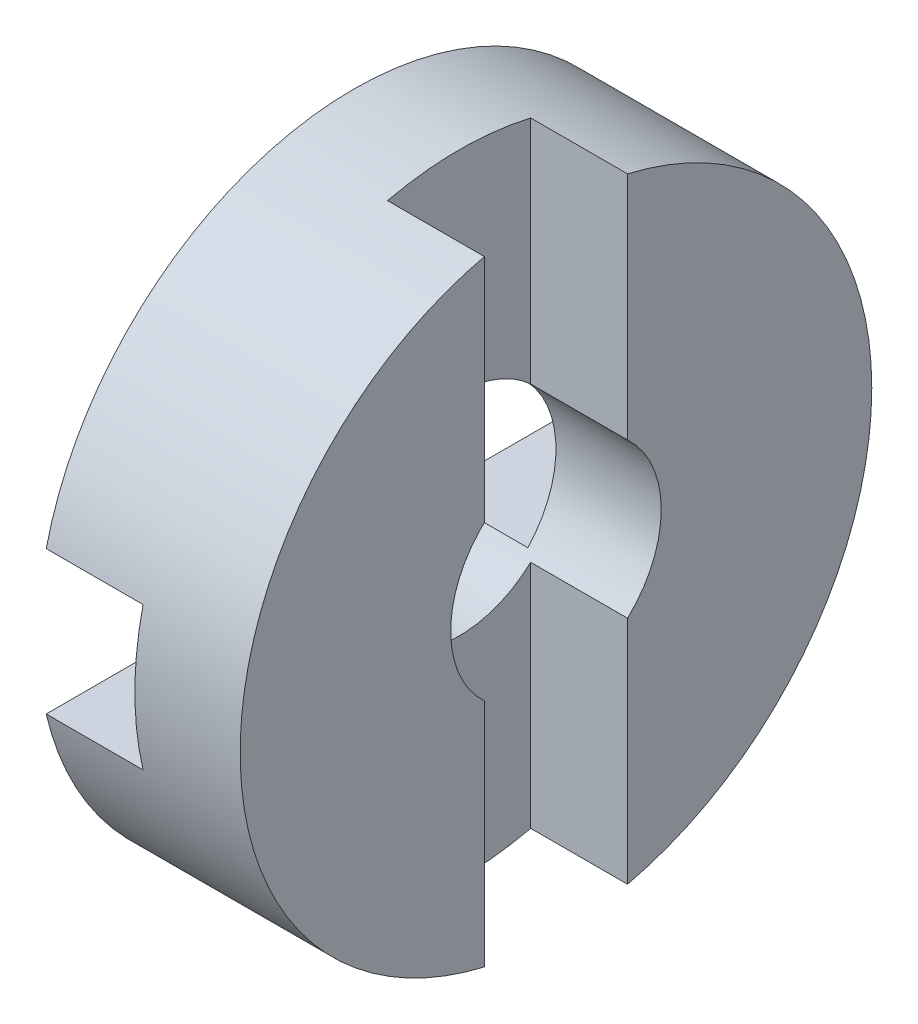
ISO-10303-21;
HEADER;
FILE_DESCRIPTION(('STEP AP214'),'2;1');
FILE_NAME('part.step','',(''),(''),'','','');
FILE_SCHEMA(('AUTOMOTIVE_DESIGN { 1 0 10303 214 1 1 1 1 }'));
ENDSEC;
DATA;
#1=APPLICATION_CONTEXT('core data for automotive mechanical design processes');
#2=APPLICATION_PROTOCOL_DEFINITION('international standard','automotive_design',2000,#1);
#3=PRODUCT_CONTEXT('',#1,'mechanical');
#4=PRODUCT('Part','Part','',(#3));
#5=PRODUCT_RELATED_PRODUCT_CATEGORY('part','',(#4));
#6=PRODUCT_DEFINITION_FORMATION('','',#4);
#7=PRODUCT_DEFINITION_CONTEXT('part definition',#1,'design');
#8=PRODUCT_DEFINITION('design','',#6,#7);
#9=PRODUCT_DEFINITION_SHAPE('','',#8);
#10=(LENGTH_UNIT() NAMED_UNIT(*) SI_UNIT(.MILLI.,.METRE.));
#11=(NAMED_UNIT(*) PLANE_ANGLE_UNIT() SI_UNIT($,.RADIAN.));
#12=(NAMED_UNIT(*) SI_UNIT($,.STERADIAN.) SOLID_ANGLE_UNIT());
#13=UNCERTAINTY_MEASURE_WITH_UNIT(LENGTH_MEASURE(1.E-05),#10,'distance_accuracy_value','');
#14=(GEOMETRIC_REPRESENTATION_CONTEXT(3) GLOBAL_UNCERTAINTY_ASSIGNED_CONTEXT((#13)) GLOBAL_UNIT_ASSIGNED_CONTEXT((#10,
#11,#12)) REPRESENTATION_CONTEXT('',''));
#15=CARTESIAN_POINT('',(0.,0.,0.));
#16=DIRECTION('',(0.,0.,1.));
#17=DIRECTION('',(1.,0.,0.));
#18=AXIS2_PLACEMENT_3D('',#15,#16,#17);
#19=CARTESIAN_POINT('',(4.8,0.,0.));
#20=DIRECTION('',(-1.,0.,0.));
#21=DIRECTION('',(0.,0.,1.));
#22=AXIS2_PLACEMENT_3D('',#19,#20,#21);
#23=CYLINDRICAL_SURFACE('',#22,7.5);
#24=CARTESIAN_POINT('',(2.3,0.,0.));
#25=DIRECTION('',(-1.,0.,0.));
#26=DIRECTION('',(0.,0.,1.));
#27=AXIS2_PLACEMENT_3D('',#24,#25,#26);
#28=CIRCLE('',#27,7.5);
#29=CARTESIAN_POINT('',(2.3,-1.7,7.30479294709987));
#30=VERTEX_POINT('',#29);
#31=CARTESIAN_POINT('',(2.3,1.7,7.30479294709987));
#32=VERTEX_POINT('',#31);
#33=EDGE_CURVE('E198',#30,#32,#28,.T.);
#34=ORIENTED_EDGE('',*,*,#33,.F.);
#35=DIRECTION('',(-1.,0.,0.));
#36=VECTOR('',#35,1.);
#37=CARTESIAN_POINT('',(4.8,-1.7,7.30479294709987));
#38=LINE('',#37,#36);
#39=CARTESIAN_POINT('',(0.,-1.7,7.30479294709987));
#40=VERTEX_POINT('',#39);
#41=EDGE_CURVE('E201',#40,#30,#38,.F.);
#42=ORIENTED_EDGE('',*,*,#41,.F.);
#43=CARTESIAN_POINT('',(0.,0.,0.));
#44=DIRECTION('',(-1.,0.,0.));
#45=DIRECTION('',(0.,0.,1.));
#46=AXIS2_PLACEMENT_3D('',#43,#44,#45);
#47=CIRCLE('',#46,7.5);
#48=CARTESIAN_POINT('',(0.,-1.7,-7.30479294709987));
#49=VERTEX_POINT('',#48);
#50=EDGE_CURVE('E215',#49,#40,#47,.T.);
#51=ORIENTED_EDGE('',*,*,#50,.F.);
#52=DIRECTION('',(-1.,0.,0.));
#53=VECTOR('',#52,1.);
#54=CARTESIAN_POINT('',(4.8,-1.7,-7.30479294709987));
#55=LINE('',#54,#53);
#56=CARTESIAN_POINT('',(2.3,-1.7,-7.30479294709987));
#57=VERTEX_POINT('',#56);
#58=EDGE_CURVE('E204',#57,#49,#55,.T.);
#59=ORIENTED_EDGE('',*,*,#58,.F.);
#60=CARTESIAN_POINT('',(2.3,1.7,-7.30479294709987));
#61=VERTEX_POINT('',#60);
#62=EDGE_CURVE('E199',#61,#57,#28,.T.);
#63=ORIENTED_EDGE('',*,*,#62,.F.);
#64=DIRECTION('',(-1.,0.,0.));
#65=VECTOR('',#64,1.);
#66=CARTESIAN_POINT('',(4.8,1.7,-7.30479294709987));
#67=LINE('',#66,#65);
#68=CARTESIAN_POINT('',(0.,1.7,-7.30479294709987));
#69=VERTEX_POINT('',#68);
#70=EDGE_CURVE('E194',#69,#61,#67,.F.);
#71=ORIENTED_EDGE('',*,*,#70,.F.);
#72=CARTESIAN_POINT('',(0.,1.7,7.30479294709987));
#73=VERTEX_POINT('',#72);
#74=EDGE_CURVE('E219',#73,#69,#47,.T.);
#75=ORIENTED_EDGE('',*,*,#74,.F.);
#76=DIRECTION('',(-1.,0.,0.));
#77=VECTOR('',#76,1.);
#78=CARTESIAN_POINT('',(4.8,1.7,7.30479294709987));
#79=LINE('',#78,#77);
#80=EDGE_CURVE('E196',#32,#73,#79,.T.);
#81=ORIENTED_EDGE('',*,*,#80,.F.);
#82=EDGE_LOOP('',(#34,#42,#51,#59,#63,#71,#75,#81));
#83=FACE_BOUND('',#82,.T.);
#84=DIRECTION('',(-1.,0.,0.));
#85=VECTOR('',#84,1.);
#86=CARTESIAN_POINT('',(4.8,7.30479294709987,-1.7));
#87=LINE('',#86,#85);
#88=CARTESIAN_POINT('',(4.8,7.30479294709987,-1.7));
#89=VERTEX_POINT('',#88);
#90=CARTESIAN_POINT('',(2.5,7.30479294709987,-1.7));
#91=VERTEX_POINT('',#90);
#92=EDGE_CURVE('E178',#89,#91,#87,.T.);
#93=ORIENTED_EDGE('',*,*,#92,.F.);
#94=CARTESIAN_POINT('',(4.8,0.,0.));
#95=DIRECTION('',(-1.,0.,0.));
#96=DIRECTION('',(0.,0.,1.));
#97=AXIS2_PLACEMENT_3D('',#94,#95,#96);
#98=CIRCLE('',#97,7.5);
#99=CARTESIAN_POINT('',(4.8,-7.30479294709987,-1.7));
#100=VERTEX_POINT('',#99);
#101=EDGE_CURVE('E207',#89,#100,#98,.T.);
#102=ORIENTED_EDGE('',*,*,#101,.T.);
#103=DIRECTION('',(-1.,0.,0.));
#104=VECTOR('',#103,1.);
#105=CARTESIAN_POINT('',(4.8,-7.30479294709987,-1.7));
#106=LINE('',#105,#104);
#107=CARTESIAN_POINT('',(2.5,-7.30479294709987,-1.7));
#108=VERTEX_POINT('',#107);
#109=EDGE_CURVE('E176',#108,#100,#106,.F.);
#110=ORIENTED_EDGE('',*,*,#109,.F.);
#111=CARTESIAN_POINT('',(2.5,0.,0.));
#112=DIRECTION('',(1.,0.,0.));
#113=DIRECTION('',(0.,0.,-1.));
#114=AXIS2_PLACEMENT_3D('',#111,#112,#113);
#115=CIRCLE('',#114,7.5);
#116=CARTESIAN_POINT('',(2.5,-7.30479294709987,1.7));
#117=VERTEX_POINT('',#116);
#118=EDGE_CURVE('E154',#117,#108,#115,.T.);
#119=ORIENTED_EDGE('',*,*,#118,.F.);
#120=DIRECTION('',(-1.,0.,0.));
#121=VECTOR('',#120,1.);
#122=CARTESIAN_POINT('',(4.8,-7.30479294709987,1.7));
#123=LINE('',#122,#121);
#124=CARTESIAN_POINT('',(4.8,-7.30479294709987,1.7));
#125=VERTEX_POINT('',#124);
#126=EDGE_CURVE('E166',#125,#117,#123,.T.);
#127=ORIENTED_EDGE('',*,*,#126,.F.);
#128=CARTESIAN_POINT('',(4.8,7.30479294709987,1.7));
#129=VERTEX_POINT('',#128);
#130=EDGE_CURVE('E165',#125,#129,#98,.T.);
#131=ORIENTED_EDGE('',*,*,#130,.T.);
#132=DIRECTION('',(-1.,0.,0.));
#133=VECTOR('',#132,1.);
#134=CARTESIAN_POINT('',(4.8,7.30479294709987,1.7));
#135=LINE('',#134,#133);
#136=CARTESIAN_POINT('',(2.5,7.30479294709987,1.7));
#137=VERTEX_POINT('',#136);
#138=EDGE_CURVE('E53',#137,#129,#135,.F.);
#139=ORIENTED_EDGE('',*,*,#138,.F.);
#140=EDGE_CURVE('E145',#91,#137,#115,.T.);
#141=ORIENTED_EDGE('',*,*,#140,.F.);
#142=EDGE_LOOP('',(#93,#102,#110,#119,#127,#131,#139,#141));
#143=FACE_BOUND('',#142,.T.);
#144=ADVANCED_FACE('F31',(#83,#143),#23,.T.);
#145=CARTESIAN_POINT('',(4.8,0.,0.));
#146=DIRECTION('',(-1.,0.,0.));
#147=DIRECTION('',(0.,0.,1.));
#148=AXIS2_PLACEMENT_3D('',#145,#146,#147);
#149=CYLINDRICAL_SURFACE('',#148,2.5);
#150=DIRECTION('',(-1.,0.,0.));
#151=VECTOR('',#150,1.);
#152=CARTESIAN_POINT('',(4.8,-1.7,1.83303027798234));
#153=LINE('',#152,#151);
#154=CARTESIAN_POINT('',(2.3,-1.7,1.83303027798234));
#155=VERTEX_POINT('',#154);
#156=CARTESIAN_POINT('',(0.,-1.7,1.83303027798234));
#157=VERTEX_POINT('',#156);
#158=EDGE_CURVE('E230',#155,#157,#153,.T.);
#159=ORIENTED_EDGE('',*,*,#158,.F.);
#160=CARTESIAN_POINT('',(2.3,0.,0.));
#161=DIRECTION('',(-1.,0.,0.));
#162=DIRECTION('',(0.,0.,1.));
#163=AXIS2_PLACEMENT_3D('',#160,#161,#162);
#164=CIRCLE('',#163,2.5);
#165=CARTESIAN_POINT('',(2.3,1.7,1.83303027798234));
#166=VERTEX_POINT('',#165);
#167=EDGE_CURVE('E226',#166,#155,#164,.F.);
#168=ORIENTED_EDGE('',*,*,#167,.F.);
#169=DIRECTION('',(-1.,0.,0.));
#170=VECTOR('',#169,1.);
#171=CARTESIAN_POINT('',(4.8,1.7,1.83303027798234));
#172=LINE('',#171,#170);
#173=CARTESIAN_POINT('',(0.,1.7,1.83303027798234));
#174=VERTEX_POINT('',#173);
#175=EDGE_CURVE('E228',#174,#166,#172,.F.);
#176=ORIENTED_EDGE('',*,*,#175,.F.);
#177=CARTESIAN_POINT('',(0.,0.,0.));
#178=DIRECTION('',(-1.,0.,0.));
#179=DIRECTION('',(0.,0.,1.));
#180=AXIS2_PLACEMENT_3D('',#177,#178,#179);
#181=CIRCLE('',#180,2.5);
#182=CARTESIAN_POINT('',(0.,1.7,-1.83303027798234));
#183=VERTEX_POINT('',#182);
#184=EDGE_CURVE('E212',#174,#183,#181,.T.);
#185=ORIENTED_EDGE('',*,*,#184,.T.);
#186=DIRECTION('',(-1.,0.,0.));
#187=VECTOR('',#186,1.);
#188=CARTESIAN_POINT('',(4.8,1.7,-1.83303027798234));
#189=LINE('',#188,#187);
#190=CARTESIAN_POINT('',(2.3,1.7,-1.83303027798234));
#191=VERTEX_POINT('',#190);
#192=EDGE_CURVE('E220',#191,#183,#189,.T.);
#193=ORIENTED_EDGE('',*,*,#192,.F.);
#194=CARTESIAN_POINT('',(2.3,-1.7,-1.83303027798234));
#195=VERTEX_POINT('',#194);
#196=EDGE_CURVE('E222',#195,#191,#164,.F.);
#197=ORIENTED_EDGE('',*,*,#196,.F.);
#198=DIRECTION('',(-1.,0.,0.));
#199=VECTOR('',#198,1.);
#200=CARTESIAN_POINT('',(4.8,-1.7,-1.83303027798234));
#201=LINE('',#200,#199);
#202=CARTESIAN_POINT('',(0.,-1.7,-1.83303027798234));
#203=VERTEX_POINT('',#202);
#204=EDGE_CURVE('E225',#203,#195,#201,.F.);
#205=ORIENTED_EDGE('',*,*,#204,.F.);
#206=EDGE_CURVE('E216',#203,#157,#181,.T.);
#207=ORIENTED_EDGE('',*,*,#206,.T.);
#208=EDGE_LOOP('',(#159,#168,#176,#185,#193,#197,#205,#207));
#209=FACE_BOUND('',#208,.T.);
#210=DIRECTION('',(-1.,0.,0.));
#211=VECTOR('',#210,1.);
#212=CARTESIAN_POINT('',(4.8,-1.83303027798234,-1.7));
#213=LINE('',#212,#211);
#214=CARTESIAN_POINT('',(4.8,-1.83303027798234,-1.7));
#215=VERTEX_POINT('',#214);
#216=CARTESIAN_POINT('',(2.5,-1.83303027798234,-1.7));
#217=VERTEX_POINT('',#216);
#218=EDGE_CURVE('E168',#215,#217,#213,.T.);
#219=ORIENTED_EDGE('',*,*,#218,.F.);
#220=CARTESIAN_POINT('',(4.8,0.,0.));
#221=DIRECTION('',(-1.,0.,0.));
#222=DIRECTION('',(0.,0.,1.));
#223=AXIS2_PLACEMENT_3D('',#220,#221,#222);
#224=CIRCLE('',#223,2.5);
#225=CARTESIAN_POINT('',(4.8,1.83303027798234,-1.7));
#226=VERTEX_POINT('',#225);
#227=EDGE_CURVE('E211',#226,#215,#224,.T.);
#228=ORIENTED_EDGE('',*,*,#227,.F.);
#229=DIRECTION('',(-1.,0.,0.));
#230=VECTOR('',#229,1.);
#231=CARTESIAN_POINT('',(4.8,1.83303027798234,-1.7));
#232=LINE('',#231,#230);
#233=CARTESIAN_POINT('',(2.5,1.83303027798234,-1.7));
#234=VERTEX_POINT('',#233);
#235=EDGE_CURVE('E174',#234,#226,#232,.F.);
#236=ORIENTED_EDGE('',*,*,#235,.F.);
#237=CARTESIAN_POINT('',(2.5,0.,0.));
#238=DIRECTION('',(1.,0.,0.));
#239=DIRECTION('',(0.,0.,-1.));
#240=AXIS2_PLACEMENT_3D('',#237,#238,#239);
#241=CIRCLE('',#240,2.5);
#242=CARTESIAN_POINT('',(2.5,1.83303027798234,1.7));
#243=VERTEX_POINT('',#242);
#244=EDGE_CURVE('E34',#243,#234,#241,.F.);
#245=ORIENTED_EDGE('',*,*,#244,.F.);
#246=DIRECTION('',(-1.,0.,0.));
#247=VECTOR('',#246,1.);
#248=CARTESIAN_POINT('',(4.8,1.83303027798234,1.7));
#249=LINE('',#248,#247);
#250=CARTESIAN_POINT('',(4.8,1.83303027798234,1.7));
#251=VERTEX_POINT('',#250);
#252=EDGE_CURVE('E158',#251,#243,#249,.T.);
#253=ORIENTED_EDGE('',*,*,#252,.F.);
#254=CARTESIAN_POINT('',(4.8,-1.83303027798234,1.7));
#255=VERTEX_POINT('',#254);
#256=EDGE_CURVE('E208',#255,#251,#224,.T.);
#257=ORIENTED_EDGE('',*,*,#256,.F.);
#258=DIRECTION('',(-1.,0.,0.));
#259=VECTOR('',#258,1.);
#260=CARTESIAN_POINT('',(4.8,-1.83303027798234,1.7));
#261=LINE('',#260,#259);
#262=CARTESIAN_POINT('',(2.5,-1.83303027798234,1.7));
#263=VERTEX_POINT('',#262);
#264=EDGE_CURVE('E45',#263,#255,#261,.F.);
#265=ORIENTED_EDGE('',*,*,#264,.F.);
#266=EDGE_CURVE('E11',#217,#263,#241,.F.);
#267=ORIENTED_EDGE('',*,*,#266,.F.);
#268=EDGE_LOOP('',(#219,#228,#236,#245,#253,#257,#265,#267));
#269=FACE_BOUND('',#268,.T.);
#270=ADVANCED_FACE('F242',(#209,#269),#149,.F.);
#271=CARTESIAN_POINT('',(4.8,2.5,0.));
#272=DIRECTION('',(-1.,0.,0.));
#273=DIRECTION('',(0.,0.,1.));
#274=AXIS2_PLACEMENT_3D('',#271,#272,#273);
#275=PLANE('',#274);
#276=DIRECTION('',(0.,1.,0.));
#277=VECTOR('',#276,1.);
#278=CARTESIAN_POINT('',(4.8,2.5,-1.7));
#279=LINE('',#278,#277);
#280=EDGE_CURVE('E235',#100,#215,#279,.T.);
#281=ORIENTED_EDGE('',*,*,#280,.F.);
#282=ORIENTED_EDGE('',*,*,#101,.F.);
#283=EDGE_CURVE('E234',#226,#89,#279,.T.);
#284=ORIENTED_EDGE('',*,*,#283,.F.);
#285=ORIENTED_EDGE('',*,*,#227,.T.);
#286=EDGE_LOOP('',(#281,#282,#284,#285));
#287=FACE_BOUND('',#286,.T.);
#288=ADVANCED_FACE('F318',(#287),#275,.F.);
#289=DIRECTION('',(0.,-1.,0.));
#290=VECTOR('',#289,1.);
#291=CARTESIAN_POINT('',(4.8,2.5,1.7));
#292=LINE('',#291,#290);
#293=EDGE_CURVE('E233',#129,#251,#292,.T.);
#294=ORIENTED_EDGE('',*,*,#293,.F.);
#295=ORIENTED_EDGE('',*,*,#130,.F.);
#296=EDGE_CURVE('E232',#255,#125,#292,.T.);
#297=ORIENTED_EDGE('',*,*,#296,.F.);
#298=ORIENTED_EDGE('',*,*,#256,.T.);
#299=EDGE_LOOP('',(#294,#295,#297,#298));
#300=FACE_BOUND('',#299,.T.);
#301=ADVANCED_FACE('F244',(#300),#275,.F.);
#302=CARTESIAN_POINT('',(0.,7.5,0.));
#303=DIRECTION('',(1.,0.,0.));
#304=DIRECTION('',(0.,0.,-1.));
#305=AXIS2_PLACEMENT_3D('',#302,#303,#304);
#306=PLANE('',#305);
#307=DIRECTION('',(0.,0.,-1.));
#308=VECTOR('',#307,1.);
#309=CARTESIAN_POINT('',(0.,-1.7,7.5));
#310=LINE('',#309,#308);
#311=EDGE_CURVE('E190',#203,#49,#310,.T.);
#312=ORIENTED_EDGE('',*,*,#311,.T.);
#313=ORIENTED_EDGE('',*,*,#50,.T.);
#314=EDGE_CURVE('E193',#40,#157,#310,.T.);
#315=ORIENTED_EDGE('',*,*,#314,.T.);
#316=ORIENTED_EDGE('',*,*,#206,.F.);
#317=EDGE_LOOP('',(#312,#313,#315,#316));
#318=FACE_BOUND('',#317,.T.);
#319=ADVANCED_FACE('F272',(#318),#306,.F.);
#320=DIRECTION('',(0.,0.,-1.));
#321=VECTOR('',#320,1.);
#322=CARTESIAN_POINT('',(0.,1.7,7.5));
#323=LINE('',#322,#321);
#324=EDGE_CURVE('E181',#73,#174,#323,.T.);
#325=ORIENTED_EDGE('',*,*,#324,.F.);
#326=ORIENTED_EDGE('',*,*,#74,.T.);
#327=EDGE_CURVE('E153',#183,#69,#323,.T.);
#328=ORIENTED_EDGE('',*,*,#327,.F.);
#329=ORIENTED_EDGE('',*,*,#184,.F.);
#330=EDGE_LOOP('',(#325,#326,#328,#329));
#331=FACE_BOUND('',#330,.T.);
#332=ADVANCED_FACE('F295',(#331),#306,.F.);
#333=CARTESIAN_POINT('',(2.3,1.7,7.5));
#334=DIRECTION('',(0.,-1.,0.));
#335=DIRECTION('',(0.,0.,-1.));
#336=AXIS2_PLACEMENT_3D('',#333,#334,#335);
#337=PLANE('',#336);
#338=ORIENTED_EDGE('',*,*,#70,.T.);
#339=DIRECTION('',(0.,0.,-1.));
#340=VECTOR('',#339,1.);
#341=CARTESIAN_POINT('',(2.3,1.7,7.5));
#342=LINE('',#341,#340);
#343=EDGE_CURVE('E182',#191,#61,#342,.T.);
#344=ORIENTED_EDGE('',*,*,#343,.F.);
#345=ORIENTED_EDGE('',*,*,#192,.T.);
#346=ORIENTED_EDGE('',*,*,#327,.T.);
#347=EDGE_LOOP('',(#338,#344,#345,#346));
#348=FACE_BOUND('',#347,.T.);
#349=ADVANCED_FACE('F299',(#348),#337,.T.);
#350=CARTESIAN_POINT('',(2.3,-1.7,7.5));
#351=DIRECTION('',(-1.,0.,0.));
#352=DIRECTION('',(0.,0.,1.));
#353=AXIS2_PLACEMENT_3D('',#350,#351,#352);
#354=PLANE('',#353);
#355=ORIENTED_EDGE('',*,*,#62,.T.);
#356=DIRECTION('',(0.,0.,-1.));
#357=VECTOR('',#356,1.);
#358=CARTESIAN_POINT('',(2.3,-1.7,7.5));
#359=LINE('',#358,#357);
#360=EDGE_CURVE('E186',#195,#57,#359,.T.);
#361=ORIENTED_EDGE('',*,*,#360,.F.);
#362=ORIENTED_EDGE('',*,*,#196,.T.);
#363=ORIENTED_EDGE('',*,*,#343,.T.);
#364=EDGE_LOOP('',(#355,#361,#362,#363));
#365=FACE_BOUND('',#364,.T.);
#366=ADVANCED_FACE('F303',(#365),#354,.T.);
#367=CARTESIAN_POINT('',(0.,-1.7,7.5));
#368=DIRECTION('',(0.,1.,0.));
#369=DIRECTION('',(0.,0.,1.));
#370=AXIS2_PLACEMENT_3D('',#367,#368,#369);
#371=PLANE('',#370);
#372=ORIENTED_EDGE('',*,*,#58,.T.);
#373=ORIENTED_EDGE('',*,*,#311,.F.);
#374=ORIENTED_EDGE('',*,*,#204,.T.);
#375=ORIENTED_EDGE('',*,*,#360,.T.);
#376=EDGE_LOOP('',(#372,#373,#374,#375));
#377=FACE_BOUND('',#376,.T.);
#378=ADVANCED_FACE('F305',(#377),#371,.T.);
#379=ORIENTED_EDGE('',*,*,#41,.T.);
#380=EDGE_CURVE('E189',#30,#155,#359,.T.);
#381=ORIENTED_EDGE('',*,*,#380,.T.);
#382=ORIENTED_EDGE('',*,*,#158,.T.);
#383=ORIENTED_EDGE('',*,*,#314,.F.);
#384=EDGE_LOOP('',(#379,#381,#382,#383));
#385=FACE_BOUND('',#384,.T.);
#386=ADVANCED_FACE('F276',(#385),#371,.T.);
#387=ORIENTED_EDGE('',*,*,#33,.T.);
#388=EDGE_CURVE('E185',#32,#166,#342,.T.);
#389=ORIENTED_EDGE('',*,*,#388,.T.);
#390=ORIENTED_EDGE('',*,*,#167,.T.);
#391=ORIENTED_EDGE('',*,*,#380,.F.);
#392=EDGE_LOOP('',(#387,#389,#390,#391));
#393=FACE_BOUND('',#392,.T.);
#394=ADVANCED_FACE('F286',(#393),#354,.T.);
#395=ORIENTED_EDGE('',*,*,#80,.T.);
#396=ORIENTED_EDGE('',*,*,#324,.T.);
#397=ORIENTED_EDGE('',*,*,#175,.T.);
#398=ORIENTED_EDGE('',*,*,#388,.F.);
#399=EDGE_LOOP('',(#395,#396,#397,#398));
#400=FACE_BOUND('',#399,.T.);
#401=ADVANCED_FACE('F288',(#400),#337,.T.);
#402=CARTESIAN_POINT('',(4.8,7.5,-1.7));
#403=DIRECTION('',(0.,0.,1.));
#404=DIRECTION('',(1.,0.,0.));
#405=AXIS2_PLACEMENT_3D('',#402,#403,#404);
#406=PLANE('',#405);
#407=ORIENTED_EDGE('',*,*,#109,.T.);
#408=ORIENTED_EDGE('',*,*,#280,.T.);
#409=ORIENTED_EDGE('',*,*,#218,.T.);
#410=DIRECTION('',(0.,-1.,0.));
#411=VECTOR('',#410,1.);
#412=CARTESIAN_POINT('',(2.5,7.5,-1.7));
#413=LINE('',#412,#411);
#414=EDGE_CURVE('E159',#217,#108,#413,.T.);
#415=ORIENTED_EDGE('',*,*,#414,.T.);
#416=EDGE_LOOP('',(#407,#408,#409,#415));
#417=FACE_BOUND('',#416,.T.);
#418=ADVANCED_FACE('F256',(#417),#406,.T.);
#419=CARTESIAN_POINT('',(2.5,7.5,1.7));
#420=DIRECTION('',(0.,0.,-1.));
#421=DIRECTION('',(-1.,0.,0.));
#422=AXIS2_PLACEMENT_3D('',#419,#420,#421);
#423=PLANE('',#422);
#424=ORIENTED_EDGE('',*,*,#126,.T.);
#425=DIRECTION('',(0.,-1.,0.));
#426=VECTOR('',#425,1.);
#427=CARTESIAN_POINT('',(2.5,7.5,1.7));
#428=LINE('',#427,#426);
#429=EDGE_CURVE('E160',#263,#117,#428,.T.);
#430=ORIENTED_EDGE('',*,*,#429,.F.);
#431=ORIENTED_EDGE('',*,*,#264,.T.);
#432=ORIENTED_EDGE('',*,*,#296,.T.);
#433=EDGE_LOOP('',(#424,#430,#431,#432));
#434=FACE_BOUND('',#433,.T.);
#435=ADVANCED_FACE('F245',(#434),#423,.T.);
#436=CARTESIAN_POINT('',(2.5,7.5,-1.7));
#437=DIRECTION('',(1.,0.,0.));
#438=DIRECTION('',(0.,0.,-1.));
#439=AXIS2_PLACEMENT_3D('',#436,#437,#438);
#440=PLANE('',#439);
#441=ORIENTED_EDGE('',*,*,#118,.T.);
#442=ORIENTED_EDGE('',*,*,#414,.F.);
#443=ORIENTED_EDGE('',*,*,#266,.T.);
#444=ORIENTED_EDGE('',*,*,#429,.T.);
#445=EDGE_LOOP('',(#441,#442,#443,#444));
#446=FACE_BOUND('',#445,.T.);
#447=ADVANCED_FACE('F253',(#446),#440,.T.);
#448=ORIENTED_EDGE('',*,*,#140,.T.);
#449=EDGE_CURVE('E147',#137,#243,#428,.T.);
#450=ORIENTED_EDGE('',*,*,#449,.T.);
#451=ORIENTED_EDGE('',*,*,#244,.T.);
#452=EDGE_CURVE('E150',#91,#234,#413,.T.);
#453=ORIENTED_EDGE('',*,*,#452,.F.);
#454=EDGE_LOOP('',(#448,#450,#451,#453));
#455=FACE_BOUND('',#454,.T.);
#456=ADVANCED_FACE('F146',(#455),#440,.T.);
#457=ORIENTED_EDGE('',*,*,#92,.T.);
#458=ORIENTED_EDGE('',*,*,#452,.T.);
#459=ORIENTED_EDGE('',*,*,#235,.T.);
#460=ORIENTED_EDGE('',*,*,#283,.T.);
#461=EDGE_LOOP('',(#457,#458,#459,#460));
#462=FACE_BOUND('',#461,.T.);
#463=ADVANCED_FACE('F259',(#462),#406,.T.);
#464=ORIENTED_EDGE('',*,*,#138,.T.);
#465=ORIENTED_EDGE('',*,*,#293,.T.);
#466=ORIENTED_EDGE('',*,*,#252,.T.);
#467=ORIENTED_EDGE('',*,*,#449,.F.);
#468=EDGE_LOOP('',(#464,#465,#466,#467));
#469=FACE_BOUND('',#468,.T.);
#470=ADVANCED_FACE('F156',(#469),#423,.T.);
#471=CLOSED_SHELL('',(#144,#270,#288,#301,#319,#332,#349,#366,#378,#386,#394,#401,#418,#435,
#447,#456,#463,#470));
#472=MANIFOLD_SOLID_BREP('B2',#471);
#473=ADVANCED_BREP_SHAPE_REPRESENTATION('',(#18,#472),#14);
#474=SHAPE_DEFINITION_REPRESENTATION(#9,#473);
ENDSEC;
END-ISO-10303-21;
